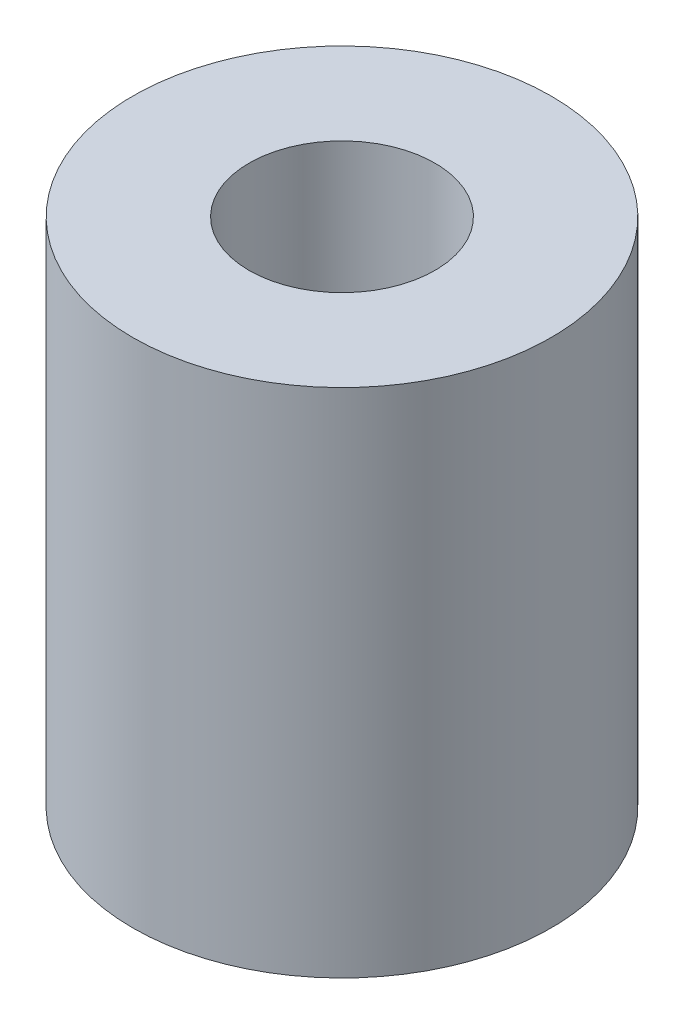
ISO-10303-21;
HEADER;
FILE_DESCRIPTION(('STEP AP214'),'2;1');
FILE_NAME('part.step','',(''),(''),'','','');
FILE_SCHEMA(('AUTOMOTIVE_DESIGN { 1 0 10303 214 1 1 1 1 }'));
ENDSEC;
DATA;
#1=APPLICATION_CONTEXT('core data for automotive mechanical design processes');
#2=APPLICATION_PROTOCOL_DEFINITION('international standard','automotive_design',2000,#1);
#3=PRODUCT_CONTEXT('',#1,'mechanical');
#4=PRODUCT('Part','Part','',(#3));
#5=PRODUCT_RELATED_PRODUCT_CATEGORY('part','',(#4));
#6=PRODUCT_DEFINITION_FORMATION('','',#4);
#7=PRODUCT_DEFINITION_CONTEXT('part definition',#1,'design');
#8=PRODUCT_DEFINITION('design','',#6,#7);
#9=PRODUCT_DEFINITION_SHAPE('','',#8);
#10=(LENGTH_UNIT() NAMED_UNIT(*) SI_UNIT(.MILLI.,.METRE.));
#11=(NAMED_UNIT(*) PLANE_ANGLE_UNIT() SI_UNIT($,.RADIAN.));
#12=(NAMED_UNIT(*) SI_UNIT($,.STERADIAN.) SOLID_ANGLE_UNIT());
#13=UNCERTAINTY_MEASURE_WITH_UNIT(LENGTH_MEASURE(1.E-05),#10,'distance_accuracy_value','');
#14=(GEOMETRIC_REPRESENTATION_CONTEXT(3) GLOBAL_UNCERTAINTY_ASSIGNED_CONTEXT((#13)) GLOBAL_UNIT_ASSIGNED_CONTEXT((#10,
#11,#12)) REPRESENTATION_CONTEXT('',''));
#15=CARTESIAN_POINT('',(0.,0.,0.));
#16=DIRECTION('',(0.,0.,1.));
#17=DIRECTION('',(1.,0.,0.));
#18=AXIS2_PLACEMENT_3D('',#15,#16,#17);
#19=CARTESIAN_POINT('',(0.,88.,0.));
#20=DIRECTION('',(0.,1.,0.));
#21=DIRECTION('',(0.,0.,1.));
#22=AXIS2_PLACEMENT_3D('',#19,#20,#21);
#23=PLANE('',#22);
#24=CARTESIAN_POINT('',(0.,88.,0.));
#25=DIRECTION('',(0.,1.,0.));
#26=DIRECTION('',(0.,0.,1.));
#27=AXIS2_PLACEMENT_3D('',#24,#25,#26);
#28=CIRCLE('',#27,36.);
#29=CARTESIAN_POINT('',(0.,88.,36.));
#30=VERTEX_POINT('',#29);
#31=EDGE_CURVE('E10',#30,#30,#28,.T.);
#32=ORIENTED_EDGE('',*,*,#31,.T.);
#33=EDGE_LOOP('',(#32));
#34=FACE_BOUND('',#33,.T.);
#35=CARTESIAN_POINT('',(0.,88.,0.));
#36=DIRECTION('',(0.,1.,0.));
#37=DIRECTION('',(0.,0.,1.));
#38=AXIS2_PLACEMENT_3D('',#35,#36,#37);
#39=CIRCLE('',#38,16.);
#40=CARTESIAN_POINT('',(0.,88.,16.));
#41=VERTEX_POINT('',#40);
#42=EDGE_CURVE('E41',#41,#41,#39,.T.);
#43=ORIENTED_EDGE('',*,*,#42,.F.);
#44=EDGE_LOOP('',(#43));
#45=FACE_BOUND('',#44,.T.);
#46=ADVANCED_FACE('F30',(#34,#45),#23,.T.);
#47=CARTESIAN_POINT('',(0.,0.,0.));
#48=DIRECTION('',(0.,1.,0.));
#49=DIRECTION('',(0.,0.,1.));
#50=AXIS2_PLACEMENT_3D('',#47,#48,#49);
#51=PLANE('',#50);
#52=CARTESIAN_POINT('',(0.,0.,0.));
#53=DIRECTION('',(0.,1.,0.));
#54=DIRECTION('',(0.,0.,1.));
#55=AXIS2_PLACEMENT_3D('',#52,#53,#54);
#56=CIRCLE('',#55,36.);
#57=CARTESIAN_POINT('',(0.,0.,36.));
#58=VERTEX_POINT('',#57);
#59=EDGE_CURVE('E34',#58,#58,#56,.T.);
#60=ORIENTED_EDGE('',*,*,#59,.F.);
#61=EDGE_LOOP('',(#60));
#62=FACE_BOUND('',#61,.T.);
#63=CARTESIAN_POINT('',(0.,0.,0.));
#64=DIRECTION('',(0.,1.,0.));
#65=DIRECTION('',(0.,0.,1.));
#66=AXIS2_PLACEMENT_3D('',#63,#64,#65);
#67=CIRCLE('',#66,16.);
#68=CARTESIAN_POINT('',(0.,0.,16.));
#69=VERTEX_POINT('',#68);
#70=EDGE_CURVE('E43',#69,#69,#67,.T.);
#71=ORIENTED_EDGE('',*,*,#70,.T.);
#72=EDGE_LOOP('',(#71));
#73=FACE_BOUND('',#72,.T.);
#74=ADVANCED_FACE('F53',(#62,#73),#51,.F.);
#75=CARTESIAN_POINT('',(0.,88.,0.));
#76=DIRECTION('',(0.,-1.,0.));
#77=DIRECTION('',(0.,0.,-1.));
#78=AXIS2_PLACEMENT_3D('',#75,#76,#77);
#79=CYLINDRICAL_SURFACE('',#78,36.);
#80=ORIENTED_EDGE('',*,*,#31,.F.);
#81=EDGE_LOOP('',(#80));
#82=FACE_BOUND('',#81,.T.);
#83=ORIENTED_EDGE('',*,*,#59,.T.);
#84=EDGE_LOOP('',(#83));
#85=FACE_BOUND('',#84,.T.);
#86=ADVANCED_FACE('F32',(#82,#85),#79,.T.);
#87=CARTESIAN_POINT('',(0.,88.,0.));
#88=DIRECTION('',(0.,-1.,0.));
#89=DIRECTION('',(0.,0.,-1.));
#90=AXIS2_PLACEMENT_3D('',#87,#88,#89);
#91=CYLINDRICAL_SURFACE('',#90,16.);
#92=ORIENTED_EDGE('',*,*,#42,.T.);
#93=EDGE_LOOP('',(#92));
#94=FACE_BOUND('',#93,.T.);
#95=ORIENTED_EDGE('',*,*,#70,.F.);
#96=EDGE_LOOP('',(#95));
#97=FACE_BOUND('',#96,.T.);
#98=ADVANCED_FACE('F49',(#94,#97),#91,.F.);
#99=CLOSED_SHELL('',(#46,#74,#86,#98));
#100=MANIFOLD_SOLID_BREP('B2',#99);
#101=ADVANCED_BREP_SHAPE_REPRESENTATION('',(#18,#100),#14);
#102=SHAPE_DEFINITION_REPRESENTATION(#9,#101);
ENDSEC;
END-ISO-10303-21;
